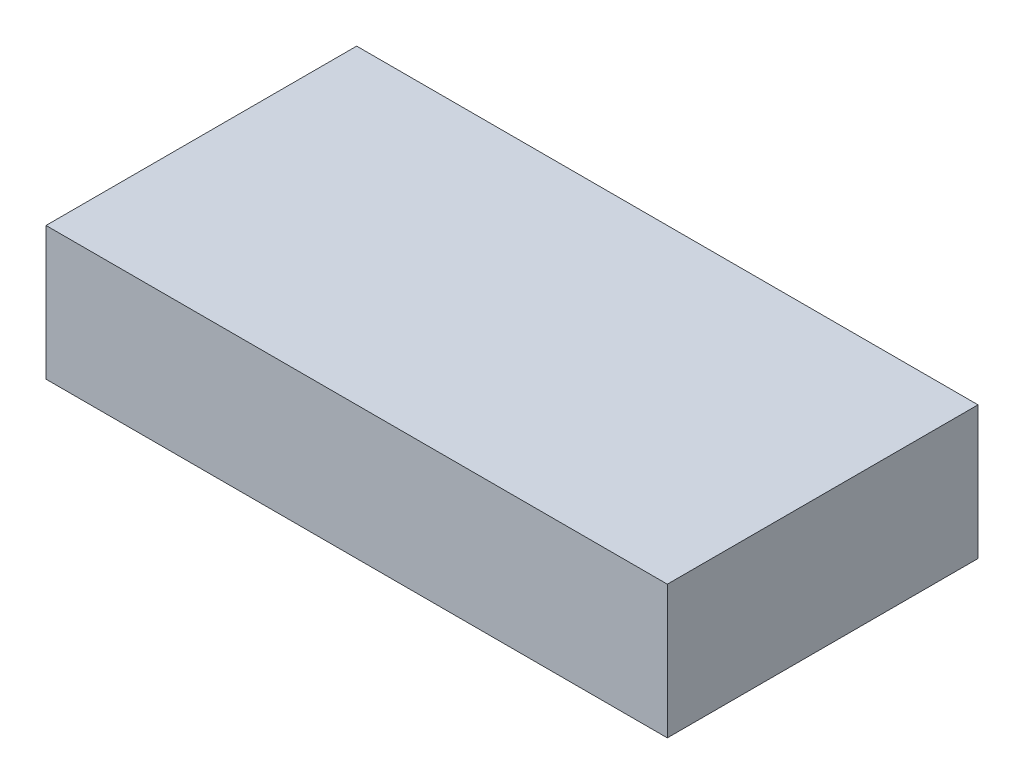
ISO-10303-21;
HEADER;
FILE_DESCRIPTION(('STEP AP214'),'2;1');
FILE_NAME('part.step','',(''),(''),'','','');
FILE_SCHEMA(('AUTOMOTIVE_DESIGN { 1 0 10303 214 1 1 1 1 }'));
ENDSEC;
DATA;
#1=APPLICATION_CONTEXT('core data for automotive mechanical design processes');
#2=APPLICATION_PROTOCOL_DEFINITION('international standard','automotive_design',2000,#1);
#3=PRODUCT_CONTEXT('',#1,'mechanical');
#4=PRODUCT('Part','Part','',(#3));
#5=PRODUCT_RELATED_PRODUCT_CATEGORY('part','',(#4));
#6=PRODUCT_DEFINITION_FORMATION('','',#4);
#7=PRODUCT_DEFINITION_CONTEXT('part definition',#1,'design');
#8=PRODUCT_DEFINITION('design','',#6,#7);
#9=PRODUCT_DEFINITION_SHAPE('','',#8);
#10=(LENGTH_UNIT() NAMED_UNIT(*) SI_UNIT(.MILLI.,.METRE.));
#11=(NAMED_UNIT(*) PLANE_ANGLE_UNIT() SI_UNIT($,.RADIAN.));
#12=(NAMED_UNIT(*) SI_UNIT($,.STERADIAN.) SOLID_ANGLE_UNIT());
#13=UNCERTAINTY_MEASURE_WITH_UNIT(LENGTH_MEASURE(1.E-05),#10,'distance_accuracy_value','');
#14=(GEOMETRIC_REPRESENTATION_CONTEXT(3) GLOBAL_UNCERTAINTY_ASSIGNED_CONTEXT((#13)) GLOBAL_UNIT_ASSIGNED_CONTEXT((#10,
#11,#12)) REPRESENTATION_CONTEXT('',''));
#15=CARTESIAN_POINT('',(0.,0.,0.));
#16=DIRECTION('',(0.,0.,1.));
#17=DIRECTION('',(1.,0.,0.));
#18=AXIS2_PLACEMENT_3D('',#15,#16,#17);
#19=CARTESIAN_POINT('',(35.,15.,-17.5));
#20=DIRECTION('',(-1.,0.,0.));
#21=DIRECTION('',(0.,0.,1.));
#22=AXIS2_PLACEMENT_3D('',#19,#20,#21);
#23=PLANE('',#22);
#24=DIRECTION('',(0.,0.,-1.));
#25=VECTOR('',#24,1.);
#26=CARTESIAN_POINT('',(35.,0.,-17.5));
#27=LINE('',#26,#25);
#28=CARTESIAN_POINT('',(35.,0.,17.5));
#29=VERTEX_POINT('',#28);
#30=CARTESIAN_POINT('',(35.,0.,-17.5));
#31=VERTEX_POINT('',#30);
#32=EDGE_CURVE('E109',#29,#31,#27,.T.);
#33=ORIENTED_EDGE('',*,*,#32,.T.);
#34=DIRECTION('',(0.,-1.,0.));
#35=VECTOR('',#34,1.);
#36=CARTESIAN_POINT('',(35.,15.,-17.5));
#37=LINE('',#36,#35);
#38=CARTESIAN_POINT('',(35.,15.,-17.5));
#39=VERTEX_POINT('',#38);
#40=EDGE_CURVE('E11',#39,#31,#37,.T.);
#41=ORIENTED_EDGE('',*,*,#40,.F.);
#42=DIRECTION('',(0.,0.,-1.));
#43=VECTOR('',#42,1.);
#44=CARTESIAN_POINT('',(35.,15.,-17.5));
#45=LINE('',#44,#43);
#46=CARTESIAN_POINT('',(35.,15.,17.5));
#47=VERTEX_POINT('',#46);
#48=EDGE_CURVE('E93',#47,#39,#45,.T.);
#49=ORIENTED_EDGE('',*,*,#48,.F.);
#50=DIRECTION('',(0.,-1.,0.));
#51=VECTOR('',#50,1.);
#52=CARTESIAN_POINT('',(35.,15.,17.5));
#53=LINE('',#52,#51);
#54=EDGE_CURVE('E105',#47,#29,#53,.T.);
#55=ORIENTED_EDGE('',*,*,#54,.T.);
#56=EDGE_LOOP('',(#33,#41,#49,#55));
#57=FACE_BOUND('',#56,.T.);
#58=ADVANCED_FACE('F41',(#57),#23,.F.);
#59=CARTESIAN_POINT('',(-35.,15.,-17.5));
#60=DIRECTION('',(0.,0.,1.));
#61=DIRECTION('',(1.,0.,0.));
#62=AXIS2_PLACEMENT_3D('',#59,#60,#61);
#63=PLANE('',#62);
#64=DIRECTION('',(-1.,0.,0.));
#65=VECTOR('',#64,1.);
#66=CARTESIAN_POINT('',(-35.,0.,-17.5));
#67=LINE('',#66,#65);
#68=CARTESIAN_POINT('',(-35.,0.,-17.5));
#69=VERTEX_POINT('',#68);
#70=EDGE_CURVE('E98',#31,#69,#67,.T.);
#71=ORIENTED_EDGE('',*,*,#70,.T.);
#72=DIRECTION('',(0.,-1.,0.));
#73=VECTOR('',#72,1.);
#74=CARTESIAN_POINT('',(-35.,15.,-17.5));
#75=LINE('',#74,#73);
#76=CARTESIAN_POINT('',(-35.,15.,-17.5));
#77=VERTEX_POINT('',#76);
#78=EDGE_CURVE('E50',#77,#69,#75,.T.);
#79=ORIENTED_EDGE('',*,*,#78,.F.);
#80=DIRECTION('',(-1.,0.,0.));
#81=VECTOR('',#80,1.);
#82=CARTESIAN_POINT('',(-35.,15.,-17.5));
#83=LINE('',#82,#81);
#84=EDGE_CURVE('E88',#39,#77,#83,.T.);
#85=ORIENTED_EDGE('',*,*,#84,.F.);
#86=ORIENTED_EDGE('',*,*,#40,.T.);
#87=EDGE_LOOP('',(#71,#79,#85,#86));
#88=FACE_BOUND('',#87,.T.);
#89=ADVANCED_FACE('F97',(#88),#63,.F.);
#90=CARTESIAN_POINT('',(-35.,15.,-17.5));
#91=DIRECTION('',(1.,0.,0.));
#92=DIRECTION('',(0.,0.,-1.));
#93=AXIS2_PLACEMENT_3D('',#90,#91,#92);
#94=PLANE('',#93);
#95=DIRECTION('',(0.,0.,1.));
#96=VECTOR('',#95,1.);
#97=CARTESIAN_POINT('',(-35.,0.,-17.5));
#98=LINE('',#97,#96);
#99=CARTESIAN_POINT('',(-35.,0.,17.5));
#100=VERTEX_POINT('',#99);
#101=EDGE_CURVE('E75',#69,#100,#98,.T.);
#102=ORIENTED_EDGE('',*,*,#101,.T.);
#103=DIRECTION('',(0.,-1.,0.));
#104=VECTOR('',#103,1.);
#105=CARTESIAN_POINT('',(-35.,15.,17.5));
#106=LINE('',#105,#104);
#107=CARTESIAN_POINT('',(-35.,15.,17.5));
#108=VERTEX_POINT('',#107);
#109=EDGE_CURVE('E100',#108,#100,#106,.T.);
#110=ORIENTED_EDGE('',*,*,#109,.F.);
#111=DIRECTION('',(0.,0.,1.));
#112=VECTOR('',#111,1.);
#113=CARTESIAN_POINT('',(-35.,15.,-17.5));
#114=LINE('',#113,#112);
#115=EDGE_CURVE('E91',#77,#108,#114,.T.);
#116=ORIENTED_EDGE('',*,*,#115,.F.);
#117=ORIENTED_EDGE('',*,*,#78,.T.);
#118=EDGE_LOOP('',(#102,#110,#116,#117));
#119=FACE_BOUND('',#118,.T.);
#120=ADVANCED_FACE('F101',(#119),#94,.F.);
#121=CARTESIAN_POINT('',(-35.,15.,17.5));
#122=DIRECTION('',(0.,0.,-1.));
#123=DIRECTION('',(-1.,0.,0.));
#124=AXIS2_PLACEMENT_3D('',#121,#122,#123);
#125=PLANE('',#124);
#126=DIRECTION('',(1.,0.,0.));
#127=VECTOR('',#126,1.);
#128=CARTESIAN_POINT('',(-35.,0.,17.5));
#129=LINE('',#128,#127);
#130=EDGE_CURVE('E81',#100,#29,#129,.T.);
#131=ORIENTED_EDGE('',*,*,#130,.T.);
#132=ORIENTED_EDGE('',*,*,#54,.F.);
#133=DIRECTION('',(1.,0.,0.));
#134=VECTOR('',#133,1.);
#135=CARTESIAN_POINT('',(-35.,15.,17.5));
#136=LINE('',#135,#134);
#137=EDGE_CURVE('E58',#108,#47,#136,.T.);
#138=ORIENTED_EDGE('',*,*,#137,.F.);
#139=ORIENTED_EDGE('',*,*,#109,.T.);
#140=EDGE_LOOP('',(#131,#132,#138,#139));
#141=FACE_BOUND('',#140,.T.);
#142=ADVANCED_FACE('F122',(#141),#125,.F.);
#143=CARTESIAN_POINT('',(0.,15.,0.));
#144=DIRECTION('',(0.,1.,0.));
#145=DIRECTION('',(0.,0.,1.));
#146=AXIS2_PLACEMENT_3D('',#143,#144,#145);
#147=PLANE('',#146);
#148=ORIENTED_EDGE('',*,*,#48,.T.);
#149=ORIENTED_EDGE('',*,*,#84,.T.);
#150=ORIENTED_EDGE('',*,*,#115,.T.);
#151=ORIENTED_EDGE('',*,*,#137,.T.);
#152=EDGE_LOOP('',(#148,#149,#150,#151));
#153=FACE_BOUND('',#152,.T.);
#154=ADVANCED_FACE('F89',(#153),#147,.T.);
#155=CARTESIAN_POINT('',(0.,0.,0.));
#156=DIRECTION('',(0.,1.,0.));
#157=DIRECTION('',(0.,0.,1.));
#158=AXIS2_PLACEMENT_3D('',#155,#156,#157);
#159=PLANE('',#158);
#160=ORIENTED_EDGE('',*,*,#32,.F.);
#161=ORIENTED_EDGE('',*,*,#130,.F.);
#162=ORIENTED_EDGE('',*,*,#101,.F.);
#163=ORIENTED_EDGE('',*,*,#70,.F.);
#164=EDGE_LOOP('',(#160,#161,#162,#163));
#165=FACE_BOUND('',#164,.T.);
#166=ADVANCED_FACE('F125',(#165),#159,.F.);
#167=CLOSED_SHELL('',(#58,#89,#120,#142,#154,#166));
#168=MANIFOLD_SOLID_BREP('B2',#167);
#169=ADVANCED_BREP_SHAPE_REPRESENTATION('',(#18,#168),#14);
#170=SHAPE_DEFINITION_REPRESENTATION(#9,#169);
ENDSEC;
END-ISO-10303-21;
